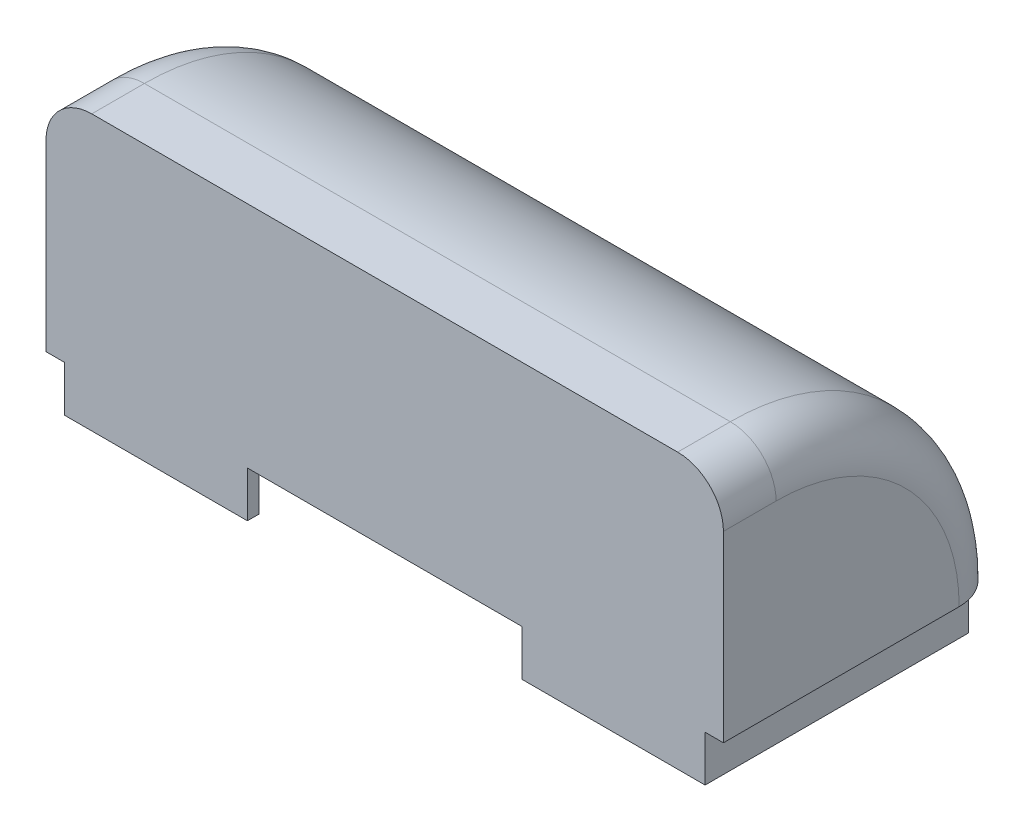
ISO-10303-21;
HEADER;
FILE_DESCRIPTION(('STEP AP214'),'2;1');
FILE_NAME('part.step','',(''),(''),'','','');
FILE_SCHEMA(('AUTOMOTIVE_DESIGN { 1 0 10303 214 1 1 1 1 }'));
ENDSEC;
DATA;
#1=APPLICATION_CONTEXT('core data for automotive mechanical design processes');
#2=APPLICATION_PROTOCOL_DEFINITION('international standard','automotive_design',2000,#1);
#3=PRODUCT_CONTEXT('',#1,'mechanical');
#4=PRODUCT('Part','Part','',(#3));
#5=PRODUCT_RELATED_PRODUCT_CATEGORY('part','',(#4));
#6=PRODUCT_DEFINITION_FORMATION('','',#4);
#7=PRODUCT_DEFINITION_CONTEXT('part definition',#1,'design');
#8=PRODUCT_DEFINITION('design','',#6,#7);
#9=PRODUCT_DEFINITION_SHAPE('','',#8);
#10=(LENGTH_UNIT() NAMED_UNIT(*) SI_UNIT(.MILLI.,.METRE.));
#11=(NAMED_UNIT(*) PLANE_ANGLE_UNIT() SI_UNIT($,.RADIAN.));
#12=(NAMED_UNIT(*) SI_UNIT($,.STERADIAN.) SOLID_ANGLE_UNIT());
#13=UNCERTAINTY_MEASURE_WITH_UNIT(LENGTH_MEASURE(1.E-05),#10,'distance_accuracy_value','');
#14=(GEOMETRIC_REPRESENTATION_CONTEXT(3) GLOBAL_UNCERTAINTY_ASSIGNED_CONTEXT((#13)) GLOBAL_UNIT_ASSIGNED_CONTEXT((#10,
#11,#12)) REPRESENTATION_CONTEXT('',''));
#15=CARTESIAN_POINT('',(0.,0.,0.));
#16=DIRECTION('',(0.,0.,1.));
#17=DIRECTION('',(1.,0.,0.));
#18=AXIS2_PLACEMENT_3D('',#15,#16,#17);
#19=CARTESIAN_POINT('',(0.,12.,0.));
#20=DIRECTION('',(0.,1.,0.));
#21=DIRECTION('',(0.,0.,1.));
#22=AXIS2_PLACEMENT_3D('',#19,#20,#21);
#23=PLANE('',#22);
#24=DIRECTION('',(1.,0.,0.));
#25=VECTOR('',#24,1.);
#26=CARTESIAN_POINT('',(-14.801,12.,3.45));
#27=LINE('',#26,#25);
#28=CARTESIAN_POINT('',(-12.8,12.,3.45));
#29=VERTEX_POINT('',#28);
#30=CARTESIAN_POINT('',(12.8,12.,3.45));
#31=VERTEX_POINT('',#30);
#32=EDGE_CURVE('E189',#29,#31,#27,.T.);
#33=ORIENTED_EDGE('',*,*,#32,.F.);
#34=DIRECTION('',(0.,0.,1.));
#35=VECTOR('',#34,1.);
#36=CARTESIAN_POINT('',(-12.8,12.,5.75));
#37=LINE('',#36,#35);
#38=CARTESIAN_POINT('',(-12.8,12.,5.75));
#39=VERTEX_POINT('',#38);
#40=EDGE_CURVE('E284',#29,#39,#37,.T.);
#41=ORIENTED_EDGE('',*,*,#40,.T.);
#42=DIRECTION('',(1.,0.,0.));
#43=VECTOR('',#42,1.);
#44=CARTESIAN_POINT('',(0.,12.,5.75));
#45=LINE('',#44,#43);
#46=CARTESIAN_POINT('',(12.8,12.,5.75));
#47=VERTEX_POINT('',#46);
#48=EDGE_CURVE('E206',#39,#47,#45,.T.);
#49=ORIENTED_EDGE('',*,*,#48,.T.);
#50=DIRECTION('',(0.,0.,-1.));
#51=VECTOR('',#50,1.);
#52=CARTESIAN_POINT('',(12.8,12.,3.45));
#53=LINE('',#52,#51);
#54=EDGE_CURVE('E281',#47,#31,#53,.T.);
#55=ORIENTED_EDGE('',*,*,#54,.T.);
#56=EDGE_LOOP('',(#33,#41,#49,#55));
#57=FACE_BOUND('',#56,.T.);
#58=ADVANCED_FACE('F35',(#57),#23,.T.);
#59=CARTESIAN_POINT('',(-6.,2.,0.));
#60=DIRECTION('',(-1.,0.,0.));
#61=DIRECTION('',(0.,0.,1.));
#62=AXIS2_PLACEMENT_3D('',#59,#60,#61);
#63=PLANE('',#62);
#64=DIRECTION('',(0.,0.,-1.));
#65=VECTOR('',#64,1.);
#66=CARTESIAN_POINT('',(-6.,0.,0.));
#67=LINE('',#66,#65);
#68=CARTESIAN_POINT('',(-6.,0.,5.75));
#69=VERTEX_POINT('',#68);
#70=CARTESIAN_POINT('',(-6.,0.,5.25));
#71=VERTEX_POINT('',#70);
#72=EDGE_CURVE('E235',#69,#71,#67,.T.);
#73=ORIENTED_EDGE('',*,*,#72,.T.);
#74=DIRECTION('',(0.,-1.,0.));
#75=VECTOR('',#74,1.);
#76=CARTESIAN_POINT('',(-6.,2.,5.25));
#77=LINE('',#76,#75);
#78=CARTESIAN_POINT('',(-6.,2.,5.25));
#79=VERTEX_POINT('',#78);
#80=EDGE_CURVE('E275',#79,#71,#77,.T.);
#81=ORIENTED_EDGE('',*,*,#80,.F.);
#82=DIRECTION('',(0.,0.,-1.));
#83=VECTOR('',#82,1.);
#84=CARTESIAN_POINT('',(-6.,2.,0.));
#85=LINE('',#84,#83);
#86=CARTESIAN_POINT('',(-6.,2.,5.75));
#87=VERTEX_POINT('',#86);
#88=EDGE_CURVE('E209',#87,#79,#85,.T.);
#89=ORIENTED_EDGE('',*,*,#88,.F.);
#90=DIRECTION('',(0.,-1.,0.));
#91=VECTOR('',#90,1.);
#92=CARTESIAN_POINT('',(-6.,2.,5.75));
#93=LINE('',#92,#91);
#94=EDGE_CURVE('E278',#87,#69,#93,.T.);
#95=ORIENTED_EDGE('',*,*,#94,.T.);
#96=EDGE_LOOP('',(#73,#81,#89,#95));
#97=FACE_BOUND('',#96,.T.);
#98=ADVANCED_FACE('F350',(#97),#63,.F.);
#99=CARTESIAN_POINT('',(0.,2.,5.25));
#100=DIRECTION('',(0.,0.,1.));
#101=DIRECTION('',(1.,0.,0.));
#102=AXIS2_PLACEMENT_3D('',#99,#100,#101);
#103=PLANE('',#102);
#104=DIRECTION('',(-1.,0.,0.));
#105=VECTOR('',#104,1.);
#106=CARTESIAN_POINT('',(0.,0.,5.25));
#107=LINE('',#106,#105);
#108=CARTESIAN_POINT('',(-13.5,0.,5.25));
#109=VERTEX_POINT('',#108);
#110=EDGE_CURVE('E238',#71,#109,#107,.T.);
#111=ORIENTED_EDGE('',*,*,#110,.T.);
#112=DIRECTION('',(0.,-1.,0.));
#113=VECTOR('',#112,1.);
#114=CARTESIAN_POINT('',(-13.5,2.,5.25));
#115=LINE('',#114,#113);
#116=CARTESIAN_POINT('',(-13.5,2.,5.25));
#117=VERTEX_POINT('',#116);
#118=EDGE_CURVE('E272',#117,#109,#115,.T.);
#119=ORIENTED_EDGE('',*,*,#118,.F.);
#120=DIRECTION('',(-1.,0.,0.));
#121=VECTOR('',#120,1.);
#122=CARTESIAN_POINT('',(0.,2.,5.25));
#123=LINE('',#122,#121);
#124=EDGE_CURVE('E212',#79,#117,#123,.T.);
#125=ORIENTED_EDGE('',*,*,#124,.F.);
#126=ORIENTED_EDGE('',*,*,#80,.T.);
#127=EDGE_LOOP('',(#111,#119,#125,#126));
#128=FACE_BOUND('',#127,.T.);
#129=ADVANCED_FACE('F382',(#128),#103,.F.);
#130=CARTESIAN_POINT('',(-13.5,2.,0.));
#131=DIRECTION('',(-1.,0.,0.));
#132=DIRECTION('',(0.,0.,1.));
#133=AXIS2_PLACEMENT_3D('',#130,#131,#132);
#134=PLANE('',#133);
#135=DIRECTION('',(0.,0.,-1.));
#136=VECTOR('',#135,1.);
#137=CARTESIAN_POINT('',(-13.5,0.,0.));
#138=LINE('',#137,#136);
#139=CARTESIAN_POINT('',(-13.5,0.,-5.25));
#140=VERTEX_POINT('',#139);
#141=EDGE_CURVE('E240',#109,#140,#138,.T.);
#142=ORIENTED_EDGE('',*,*,#141,.T.);
#143=DIRECTION('',(0.,0.707106781186552,0.707106781186543));
#144=VECTOR('',#143,1.);
#145=CARTESIAN_POINT('',(-13.5,0.,-5.25));
#146=LINE('',#145,#144);
#147=CARTESIAN_POINT('',(-13.5,2.,-3.25000000000001));
#148=VERTEX_POINT('',#147);
#149=EDGE_CURVE('E57',#140,#148,#146,.T.);
#150=ORIENTED_EDGE('',*,*,#149,.T.);
#151=DIRECTION('',(0.,0.,-1.));
#152=VECTOR('',#151,1.);
#153=CARTESIAN_POINT('',(-13.5,2.,0.));
#154=LINE('',#153,#152);
#155=EDGE_CURVE('E216',#117,#148,#154,.T.);
#156=ORIENTED_EDGE('',*,*,#155,.F.);
#157=ORIENTED_EDGE('',*,*,#118,.T.);
#158=EDGE_LOOP('',(#142,#150,#156,#157));
#159=FACE_BOUND('',#158,.T.);
#160=ADVANCED_FACE('F414',(#159),#134,.F.);
#161=CARTESIAN_POINT('',(13.5,2.,0.));
#162=DIRECTION('',(-1.,0.,0.));
#163=DIRECTION('',(0.,0.,1.));
#164=AXIS2_PLACEMENT_3D('',#161,#162,#163);
#165=PLANE('',#164);
#166=DIRECTION('',(0.,0.,-1.));
#167=VECTOR('',#166,1.);
#168=CARTESIAN_POINT('',(13.5,2.,0.));
#169=LINE('',#168,#167);
#170=CARTESIAN_POINT('',(13.5,2.,5.25));
#171=VERTEX_POINT('',#170);
#172=CARTESIAN_POINT('',(13.5,2.,-3.25000000000001));
#173=VERTEX_POINT('',#172);
#174=EDGE_CURVE('E219',#171,#173,#169,.T.);
#175=ORIENTED_EDGE('',*,*,#174,.T.);
#176=DIRECTION('',(0.,-0.707106781186552,-0.707106781186543));
#177=VECTOR('',#176,1.);
#178=CARTESIAN_POINT('',(13.5,3.625,-1.62500000000002));
#179=LINE('',#178,#177);
#180=CARTESIAN_POINT('',(13.5,0.,-5.25));
#181=VERTEX_POINT('',#180);
#182=EDGE_CURVE('E11',#173,#181,#179,.T.);
#183=ORIENTED_EDGE('',*,*,#182,.T.);
#184=DIRECTION('',(0.,0.,-1.));
#185=VECTOR('',#184,1.);
#186=CARTESIAN_POINT('',(13.5,0.,0.));
#187=LINE('',#186,#185);
#188=CARTESIAN_POINT('',(13.5,0.,5.25));
#189=VERTEX_POINT('',#188);
#190=EDGE_CURVE('E246',#189,#181,#187,.T.);
#191=ORIENTED_EDGE('',*,*,#190,.F.);
#192=DIRECTION('',(0.,-1.,0.));
#193=VECTOR('',#192,1.);
#194=CARTESIAN_POINT('',(13.5,2.,5.25));
#195=LINE('',#194,#193);
#196=EDGE_CURVE('E270',#171,#189,#195,.T.);
#197=ORIENTED_EDGE('',*,*,#196,.F.);
#198=EDGE_LOOP('',(#175,#183,#191,#197));
#199=FACE_BOUND('',#198,.T.);
#200=ADVANCED_FACE('F408',(#199),#165,.T.);
#201=CARTESIAN_POINT('',(6.,0.,5.25));
#202=VERTEX_POINT('',#201);
#203=EDGE_CURVE('E241',#189,#202,#107,.T.);
#204=ORIENTED_EDGE('',*,*,#203,.T.);
#205=DIRECTION('',(0.,-1.,0.));
#206=VECTOR('',#205,1.);
#207=CARTESIAN_POINT('',(6.,2.,5.25));
#208=LINE('',#207,#206);
#209=CARTESIAN_POINT('',(6.,2.,5.25));
#210=VERTEX_POINT('',#209);
#211=EDGE_CURVE('E268',#210,#202,#208,.T.);
#212=ORIENTED_EDGE('',*,*,#211,.F.);
#213=EDGE_CURVE('E217',#171,#210,#123,.T.);
#214=ORIENTED_EDGE('',*,*,#213,.F.);
#215=ORIENTED_EDGE('',*,*,#196,.T.);
#216=EDGE_LOOP('',(#204,#212,#214,#215));
#217=FACE_BOUND('',#216,.T.);
#218=ADVANCED_FACE('F413',(#217),#103,.F.);
#219=CARTESIAN_POINT('',(6.,2.,0.));
#220=DIRECTION('',(-1.,0.,0.));
#221=DIRECTION('',(0.,0.,1.));
#222=AXIS2_PLACEMENT_3D('',#219,#220,#221);
#223=PLANE('',#222);
#224=DIRECTION('',(0.,0.,-1.));
#225=VECTOR('',#224,1.);
#226=CARTESIAN_POINT('',(6.,0.,0.));
#227=LINE('',#226,#225);
#228=CARTESIAN_POINT('',(6.,0.,5.75));
#229=VERTEX_POINT('',#228);
#230=EDGE_CURVE('E249',#229,#202,#227,.T.);
#231=ORIENTED_EDGE('',*,*,#230,.F.);
#232=DIRECTION('',(0.,-1.,0.));
#233=VECTOR('',#232,1.);
#234=CARTESIAN_POINT('',(6.,2.,5.75));
#235=LINE('',#234,#233);
#236=CARTESIAN_POINT('',(6.,2.,5.75));
#237=VERTEX_POINT('',#236);
#238=EDGE_CURVE('E266',#237,#229,#235,.T.);
#239=ORIENTED_EDGE('',*,*,#238,.F.);
#240=DIRECTION('',(0.,0.,-1.));
#241=VECTOR('',#240,1.);
#242=CARTESIAN_POINT('',(6.,2.,0.));
#243=LINE('',#242,#241);
#244=EDGE_CURVE('E221',#237,#210,#243,.T.);
#245=ORIENTED_EDGE('',*,*,#244,.T.);
#246=ORIENTED_EDGE('',*,*,#211,.T.);
#247=EDGE_LOOP('',(#231,#239,#245,#246));
#248=FACE_BOUND('',#247,.T.);
#249=ADVANCED_FACE('F359',(#248),#223,.T.);
#250=CARTESIAN_POINT('',(0.,2.,5.75));
#251=DIRECTION('',(0.,0.,-1.));
#252=DIRECTION('',(-1.,0.,0.));
#253=AXIS2_PLACEMENT_3D('',#250,#251,#252);
#254=PLANE('',#253);
#255=ORIENTED_EDGE('',*,*,#48,.F.);
#256=CARTESIAN_POINT('',(-12.8,10.,5.75));
#257=DIRECTION('',(0.,0.,-1.));
#258=DIRECTION('',(-1.,0.,0.));
#259=AXIS2_PLACEMENT_3D('',#256,#257,#258);
#260=CIRCLE('',#259,2.);
#261=CARTESIAN_POINT('',(-14.8,10.,5.75));
#262=VERTEX_POINT('',#261);
#263=EDGE_CURVE('E289',#39,#262,#260,.F.);
#264=ORIENTED_EDGE('',*,*,#263,.T.);
#265=DIRECTION('',(0.,-1.,0.));
#266=VECTOR('',#265,1.);
#267=CARTESIAN_POINT('',(-14.8,12.,5.75));
#268=LINE('',#267,#266);
#269=CARTESIAN_POINT('',(-14.8,2.,5.75));
#270=VERTEX_POINT('',#269);
#271=EDGE_CURVE('E177',#262,#270,#268,.T.);
#272=ORIENTED_EDGE('',*,*,#271,.T.);
#273=DIRECTION('',(1.,0.,0.));
#274=VECTOR('',#273,1.);
#275=CARTESIAN_POINT('',(0.,2.,5.75));
#276=LINE('',#275,#274);
#277=CARTESIAN_POINT('',(-14.,2.,5.75));
#278=VERTEX_POINT('',#277);
#279=EDGE_CURVE('E191',#270,#278,#276,.T.);
#280=ORIENTED_EDGE('',*,*,#279,.T.);
#281=DIRECTION('',(0.,-1.,0.));
#282=VECTOR('',#281,1.);
#283=CARTESIAN_POINT('',(-14.,2.,5.75));
#284=LINE('',#283,#282);
#285=CARTESIAN_POINT('',(-14.,0.,5.75));
#286=VERTEX_POINT('',#285);
#287=EDGE_CURVE('E232',#278,#286,#284,.T.);
#288=ORIENTED_EDGE('',*,*,#287,.T.);
#289=DIRECTION('',(1.,0.,0.));
#290=VECTOR('',#289,1.);
#291=CARTESIAN_POINT('',(0.,0.,5.75));
#292=LINE('',#291,#290);
#293=EDGE_CURVE('E176',#286,#69,#292,.T.);
#294=ORIENTED_EDGE('',*,*,#293,.T.);
#295=ORIENTED_EDGE('',*,*,#94,.F.);
#296=EDGE_CURVE('E188',#87,#237,#276,.T.);
#297=ORIENTED_EDGE('',*,*,#296,.T.);
#298=ORIENTED_EDGE('',*,*,#238,.T.);
#299=CARTESIAN_POINT('',(14.,0.,5.75));
#300=VERTEX_POINT('',#299);
#301=EDGE_CURVE('E236',#229,#300,#292,.T.);
#302=ORIENTED_EDGE('',*,*,#301,.T.);
#303=DIRECTION('',(0.,-1.,0.));
#304=VECTOR('',#303,1.);
#305=CARTESIAN_POINT('',(14.,2.,5.75));
#306=LINE('',#305,#304);
#307=CARTESIAN_POINT('',(14.,2.,5.75));
#308=VERTEX_POINT('',#307);
#309=EDGE_CURVE('E184',#308,#300,#306,.T.);
#310=ORIENTED_EDGE('',*,*,#309,.F.);
#311=CARTESIAN_POINT('',(14.8,2.,5.75));
#312=VERTEX_POINT('',#311);
#313=EDGE_CURVE('E180',#308,#312,#276,.T.);
#314=ORIENTED_EDGE('',*,*,#313,.T.);
#315=DIRECTION('',(0.,-1.,0.));
#316=VECTOR('',#315,1.);
#317=CARTESIAN_POINT('',(14.8,12.,5.75));
#318=LINE('',#317,#316);
#319=CARTESIAN_POINT('',(14.8,10.,5.75));
#320=VERTEX_POINT('',#319);
#321=EDGE_CURVE('E166',#320,#312,#318,.T.);
#322=ORIENTED_EDGE('',*,*,#321,.F.);
#323=CARTESIAN_POINT('',(12.8,10.,5.75));
#324=DIRECTION('',(0.,0.,-1.));
#325=DIRECTION('',(-1.,0.,0.));
#326=AXIS2_PLACEMENT_3D('',#323,#324,#325);
#327=CIRCLE('',#326,2.);
#328=EDGE_CURVE('E287',#320,#47,#327,.F.);
#329=ORIENTED_EDGE('',*,*,#328,.T.);
#330=EDGE_LOOP('',(#255,#264,#272,#280,#288,#294,#295,#297,#298,#302,#310,#314,#322,#329));
#331=FACE_BOUND('',#330,.T.);
#332=ADVANCED_FACE('F182',(#331),#254,.F.);
#333=CARTESIAN_POINT('',(14.,2.,0.));
#334=DIRECTION('',(1.,0.,0.));
#335=DIRECTION('',(0.,0.,-1.));
#336=AXIS2_PLACEMENT_3D('',#333,#334,#335);
#337=PLANE('',#336);
#338=DIRECTION('',(0.,0.,1.));
#339=VECTOR('',#338,1.);
#340=CARTESIAN_POINT('',(14.,0.,0.));
#341=LINE('',#340,#339);
#342=CARTESIAN_POINT('',(14.,0.,-5.75));
#343=VERTEX_POINT('',#342);
#344=EDGE_CURVE('E252',#343,#300,#341,.T.);
#345=ORIENTED_EDGE('',*,*,#344,.F.);
#346=DIRECTION('',(0.,-1.,0.));
#347=VECTOR('',#346,1.);
#348=CARTESIAN_POINT('',(14.,2.,-5.75));
#349=LINE('',#348,#347);
#350=CARTESIAN_POINT('',(14.,2.,-5.75));
#351=VERTEX_POINT('',#350);
#352=EDGE_CURVE('E263',#351,#343,#349,.T.);
#353=ORIENTED_EDGE('',*,*,#352,.F.);
#354=DIRECTION('',(0.,0.,1.));
#355=VECTOR('',#354,1.);
#356=CARTESIAN_POINT('',(14.,2.,0.));
#357=LINE('',#356,#355);
#358=EDGE_CURVE('E224',#351,#308,#357,.T.);
#359=ORIENTED_EDGE('',*,*,#358,.T.);
#360=ORIENTED_EDGE('',*,*,#309,.T.);
#361=EDGE_LOOP('',(#345,#353,#359,#360));
#362=FACE_BOUND('',#361,.T.);
#363=ADVANCED_FACE('F365',(#362),#337,.T.);
#364=CARTESIAN_POINT('',(0.,2.,-5.75));
#365=DIRECTION('',(0.,0.,-1.));
#366=DIRECTION('',(-1.,0.,0.));
#367=AXIS2_PLACEMENT_3D('',#364,#365,#366);
#368=PLANE('',#367);
#369=DIRECTION('',(1.,0.,0.));
#370=VECTOR('',#369,1.);
#371=CARTESIAN_POINT('',(0.,0.,-5.75));
#372=LINE('',#371,#370);
#373=CARTESIAN_POINT('',(-14.,0.,-5.75));
#374=VERTEX_POINT('',#373);
#375=EDGE_CURVE('E255',#374,#343,#372,.T.);
#376=ORIENTED_EDGE('',*,*,#375,.F.);
#377=DIRECTION('',(0.,-1.,0.));
#378=VECTOR('',#377,1.);
#379=CARTESIAN_POINT('',(-14.,2.,-5.75));
#380=LINE('',#379,#378);
#381=CARTESIAN_POINT('',(-14.,2.,-5.75));
#382=VERTEX_POINT('',#381);
#383=EDGE_CURVE('E261',#382,#374,#380,.T.);
#384=ORIENTED_EDGE('',*,*,#383,.F.);
#385=DIRECTION('',(1.,0.,0.));
#386=VECTOR('',#385,1.);
#387=CARTESIAN_POINT('',(0.,2.,-5.75));
#388=LINE('',#387,#386);
#389=EDGE_CURVE('E226',#382,#351,#388,.T.);
#390=ORIENTED_EDGE('',*,*,#389,.T.);
#391=ORIENTED_EDGE('',*,*,#352,.T.);
#392=EDGE_LOOP('',(#376,#384,#390,#391));
#393=FACE_BOUND('',#392,.T.);
#394=ADVANCED_FACE('F367',(#393),#368,.T.);
#395=CARTESIAN_POINT('',(-14.,2.,0.));
#396=DIRECTION('',(1.,0.,0.));
#397=DIRECTION('',(0.,0.,-1.));
#398=AXIS2_PLACEMENT_3D('',#395,#396,#397);
#399=PLANE('',#398);
#400=DIRECTION('',(0.,0.,1.));
#401=VECTOR('',#400,1.);
#402=CARTESIAN_POINT('',(-14.,0.,0.));
#403=LINE('',#402,#401);
#404=EDGE_CURVE('E213',#374,#286,#403,.T.);
#405=ORIENTED_EDGE('',*,*,#404,.T.);
#406=ORIENTED_EDGE('',*,*,#287,.F.);
#407=DIRECTION('',(0.,0.,1.));
#408=VECTOR('',#407,1.);
#409=CARTESIAN_POINT('',(-14.,2.,0.));
#410=LINE('',#409,#408);
#411=EDGE_CURVE('E229',#382,#278,#410,.T.);
#412=ORIENTED_EDGE('',*,*,#411,.F.);
#413=ORIENTED_EDGE('',*,*,#383,.T.);
#414=EDGE_LOOP('',(#405,#406,#412,#413));
#415=FACE_BOUND('',#414,.T.);
#416=ADVANCED_FACE('F368',(#415),#399,.F.);
#417=CARTESIAN_POINT('',(0.,0.,0.));
#418=DIRECTION('',(0.,1.,0.));
#419=DIRECTION('',(0.,0.,1.));
#420=AXIS2_PLACEMENT_3D('',#417,#418,#419);
#421=PLANE('',#420);
#422=ORIENTED_EDGE('',*,*,#293,.F.);
#423=ORIENTED_EDGE('',*,*,#404,.F.);
#424=ORIENTED_EDGE('',*,*,#375,.T.);
#425=ORIENTED_EDGE('',*,*,#344,.T.);
#426=ORIENTED_EDGE('',*,*,#301,.F.);
#427=ORIENTED_EDGE('',*,*,#230,.T.);
#428=ORIENTED_EDGE('',*,*,#203,.F.);
#429=ORIENTED_EDGE('',*,*,#190,.T.);
#430=DIRECTION('',(-1.,0.,0.));
#431=VECTOR('',#430,1.);
#432=CARTESIAN_POINT('',(0.,0.,-5.25));
#433=LINE('',#432,#431);
#434=EDGE_CURVE('E243',#181,#140,#433,.T.);
#435=ORIENTED_EDGE('',*,*,#434,.T.);
#436=ORIENTED_EDGE('',*,*,#141,.F.);
#437=ORIENTED_EDGE('',*,*,#110,.F.);
#438=ORIENTED_EDGE('',*,*,#72,.F.);
#439=EDGE_LOOP('',(#422,#423,#424,#425,#426,#427,#428,#429,#435,#436,#437,#438));
#440=FACE_BOUND('',#439,.T.);
#441=ADVANCED_FACE('F345',(#440),#421,.F.);
#442=CARTESIAN_POINT('',(0.,2.,0.));
#443=DIRECTION('',(0.,1.,0.));
#444=DIRECTION('',(0.,0.,1.));
#445=AXIS2_PLACEMENT_3D('',#442,#443,#444);
#446=PLANE('',#445);
#447=ORIENTED_EDGE('',*,*,#155,.T.);
#448=DIRECTION('',(1.,0.,0.));
#449=VECTOR('',#448,1.);
#450=CARTESIAN_POINT('',(0.,2.,-3.25000000000001));
#451=LINE('',#450,#449);
#452=EDGE_CURVE('E43',#148,#173,#451,.T.);
#453=ORIENTED_EDGE('',*,*,#452,.T.);
#454=ORIENTED_EDGE('',*,*,#174,.F.);
#455=ORIENTED_EDGE('',*,*,#213,.T.);
#456=ORIENTED_EDGE('',*,*,#244,.F.);
#457=ORIENTED_EDGE('',*,*,#296,.F.);
#458=ORIENTED_EDGE('',*,*,#88,.T.);
#459=ORIENTED_EDGE('',*,*,#124,.T.);
#460=EDGE_LOOP('',(#447,#453,#454,#455,#456,#457,#458,#459));
#461=FACE_BOUND('',#460,.T.);
#462=ADVANCED_FACE('F354',(#461),#446,.F.);
#463=CARTESIAN_POINT('',(14.8,12.,0.));
#464=DIRECTION('',(-1.,0.,0.));
#465=DIRECTION('',(0.,0.,1.));
#466=AXIS2_PLACEMENT_3D('',#463,#464,#465);
#467=PLANE('',#466);
#468=CARTESIAN_POINT('',(14.8,2.,3.45));
#469=DIRECTION('',(-1.,0.,0.));
#470=DIRECTION('',(0.,0.,1.));
#471=AXIS2_PLACEMENT_3D('',#468,#469,#470);
#472=CIRCLE('',#471,8.);
#473=CARTESIAN_POINT('',(14.8,2.,-4.55));
#474=VERTEX_POINT('',#473);
#475=CARTESIAN_POINT('',(14.8,10.,3.45));
#476=VERTEX_POINT('',#475);
#477=EDGE_CURVE('E295',#474,#476,#472,.F.);
#478=ORIENTED_EDGE('',*,*,#477,.T.);
#479=DIRECTION('',(0.,0.,-1.));
#480=VECTOR('',#479,1.);
#481=CARTESIAN_POINT('',(14.8,10.,5.75));
#482=LINE('',#481,#480);
#483=EDGE_CURVE('E173',#476,#320,#482,.F.);
#484=ORIENTED_EDGE('',*,*,#483,.T.);
#485=ORIENTED_EDGE('',*,*,#321,.T.);
#486=DIRECTION('',(0.,0.,-1.));
#487=VECTOR('',#486,1.);
#488=CARTESIAN_POINT('',(14.8,2.,0.));
#489=LINE('',#488,#487);
#490=EDGE_CURVE('E170',#312,#474,#489,.T.);
#491=ORIENTED_EDGE('',*,*,#490,.T.);
#492=EDGE_LOOP('',(#478,#484,#485,#491));
#493=FACE_BOUND('',#492,.T.);
#494=ADVANCED_FACE('F168',(#493),#467,.F.);
#495=CARTESIAN_POINT('',(-14.8,12.,0.));
#496=DIRECTION('',(1.,0.,0.));
#497=DIRECTION('',(0.,0.,-1.));
#498=AXIS2_PLACEMENT_3D('',#495,#496,#497);
#499=PLANE('',#498);
#500=ORIENTED_EDGE('',*,*,#271,.F.);
#501=DIRECTION('',(0.,0.,1.));
#502=VECTOR('',#501,1.);
#503=CARTESIAN_POINT('',(-14.8,10.,3.45));
#504=LINE('',#503,#502);
#505=CARTESIAN_POINT('',(-14.8,10.,3.45));
#506=VERTEX_POINT('',#505);
#507=EDGE_CURVE('E293',#262,#506,#504,.F.);
#508=ORIENTED_EDGE('',*,*,#507,.T.);
#509=CARTESIAN_POINT('',(-14.8,2.,3.45));
#510=DIRECTION('',(1.,0.,0.));
#511=DIRECTION('',(0.,0.,-1.));
#512=AXIS2_PLACEMENT_3D('',#509,#510,#511);
#513=CIRCLE('',#512,8.);
#514=CARTESIAN_POINT('',(-14.8,2.,-4.55));
#515=VERTEX_POINT('',#514);
#516=EDGE_CURVE('E291',#506,#515,#513,.F.);
#517=ORIENTED_EDGE('',*,*,#516,.T.);
#518=DIRECTION('',(0.,0.,1.));
#519=VECTOR('',#518,1.);
#520=CARTESIAN_POINT('',(-14.8,2.,0.));
#521=LINE('',#520,#519);
#522=EDGE_CURVE('E200',#515,#270,#521,.T.);
#523=ORIENTED_EDGE('',*,*,#522,.T.);
#524=EDGE_LOOP('',(#500,#508,#517,#523));
#525=FACE_BOUND('',#524,.T.);
#526=ADVANCED_FACE('F337',(#525),#499,.F.);
#527=ORIENTED_EDGE('',*,*,#522,.F.);
#528=CARTESIAN_POINT('',(-12.8,2.,-4.55));
#529=DIRECTION('',(0.,1.,0.));
#530=DIRECTION('',(0.,0.,1.));
#531=AXIS2_PLACEMENT_3D('',#528,#529,#530);
#532=CIRCLE('',#531,2.);
#533=CARTESIAN_POINT('',(-12.8,2.,-6.55));
#534=VERTEX_POINT('',#533);
#535=EDGE_CURVE('E303',#515,#534,#532,.F.);
#536=ORIENTED_EDGE('',*,*,#535,.T.);
#537=DIRECTION('',(-1.,0.,0.));
#538=VECTOR('',#537,1.);
#539=CARTESIAN_POINT('',(0.,2.,-6.55));
#540=LINE('',#539,#538);
#541=CARTESIAN_POINT('',(12.8,2.,-6.55));
#542=VERTEX_POINT('',#541);
#543=EDGE_CURVE('E197',#542,#534,#540,.T.);
#544=ORIENTED_EDGE('',*,*,#543,.F.);
#545=CARTESIAN_POINT('',(12.8,2.,-4.55));
#546=DIRECTION('',(0.,1.,0.));
#547=DIRECTION('',(0.,0.,1.));
#548=AXIS2_PLACEMENT_3D('',#545,#546,#547);
#549=CIRCLE('',#548,2.);
#550=EDGE_CURVE('E196',#542,#474,#549,.F.);
#551=ORIENTED_EDGE('',*,*,#550,.T.);
#552=ORIENTED_EDGE('',*,*,#490,.F.);
#553=ORIENTED_EDGE('',*,*,#313,.F.);
#554=ORIENTED_EDGE('',*,*,#358,.F.);
#555=ORIENTED_EDGE('',*,*,#389,.F.);
#556=ORIENTED_EDGE('',*,*,#411,.T.);
#557=ORIENTED_EDGE('',*,*,#279,.F.);
#558=EDGE_LOOP('',(#527,#536,#544,#551,#552,#553,#554,#555,#556,#557));
#559=FACE_BOUND('',#558,.T.);
#560=ADVANCED_FACE('F193',(#559),#446,.F.);
#561=CARTESIAN_POINT('',(-14.801,2.,3.45));
#562=DIRECTION('',(1.,0.,0.));
#563=DIRECTION('',(0.,0.,-1.));
#564=AXIS2_PLACEMENT_3D('',#561,#562,#563);
#565=CYLINDRICAL_SURFACE('',#564,10.);
#566=ORIENTED_EDGE('',*,*,#543,.T.);
#567=CARTESIAN_POINT('',(-12.8,2.,3.45));
#568=DIRECTION('',(1.,0.,0.));
#569=DIRECTION('',(0.,0.,-1.));
#570=AXIS2_PLACEMENT_3D('',#567,#568,#569);
#571=CIRCLE('',#570,10.);
#572=EDGE_CURVE('E300',#534,#29,#571,.T.);
#573=ORIENTED_EDGE('',*,*,#572,.T.);
#574=ORIENTED_EDGE('',*,*,#32,.T.);
#575=CARTESIAN_POINT('',(12.8,2.,3.45));
#576=DIRECTION('',(-1.,0.,0.));
#577=DIRECTION('',(0.,0.,1.));
#578=AXIS2_PLACEMENT_3D('',#575,#576,#577);
#579=CIRCLE('',#578,10.);
#580=EDGE_CURVE('E298',#31,#542,#579,.T.);
#581=ORIENTED_EDGE('',*,*,#580,.T.);
#582=EDGE_LOOP('',(#566,#573,#574,#581));
#583=FACE_BOUND('',#582,.T.);
#584=ADVANCED_FACE('F323',(#583),#565,.T.);
#585=CARTESIAN_POINT('',(-12.8,2.,3.45));
#586=DIRECTION('',(1.,0.,0.));
#587=DIRECTION('',(0.,0.,-1.));
#588=AXIS2_PLACEMENT_3D('',#585,#586,#587);
#589=TOROIDAL_SURFACE('',#588,8.,2.);
#590=ORIENTED_EDGE('',*,*,#535,.F.);
#591=ORIENTED_EDGE('',*,*,#516,.F.);
#592=CARTESIAN_POINT('',(-12.8,10.,3.45));
#593=DIRECTION('',(0.,0.,1.));
#594=DIRECTION('',(1.,0.,0.));
#595=AXIS2_PLACEMENT_3D('',#592,#593,#594);
#596=CIRCLE('',#595,2.);
#597=EDGE_CURVE('E305',#29,#506,#596,.T.);
#598=ORIENTED_EDGE('',*,*,#597,.F.);
#599=ORIENTED_EDGE('',*,*,#572,.F.);
#600=EDGE_LOOP('',(#590,#591,#598,#599));
#601=FACE_BOUND('',#600,.T.);
#602=ADVANCED_FACE('F328',(#601),#589,.T.);
#603=CARTESIAN_POINT('',(-12.8,10.,0.));
#604=DIRECTION('',(0.,0.,-1.));
#605=DIRECTION('',(-1.,0.,0.));
#606=AXIS2_PLACEMENT_3D('',#603,#604,#605);
#607=CYLINDRICAL_SURFACE('',#606,2.);
#608=ORIENTED_EDGE('',*,*,#597,.T.);
#609=ORIENTED_EDGE('',*,*,#507,.F.);
#610=ORIENTED_EDGE('',*,*,#263,.F.);
#611=ORIENTED_EDGE('',*,*,#40,.F.);
#612=EDGE_LOOP('',(#608,#609,#610,#611));
#613=FACE_BOUND('',#612,.T.);
#614=ADVANCED_FACE('F333',(#613),#607,.T.);
#615=CARTESIAN_POINT('',(12.8,2.,3.45));
#616=DIRECTION('',(-1.,0.,0.));
#617=DIRECTION('',(0.,0.,1.));
#618=AXIS2_PLACEMENT_3D('',#615,#616,#617);
#619=TOROIDAL_SURFACE('',#618,8.,2.);
#620=ORIENTED_EDGE('',*,*,#550,.F.);
#621=ORIENTED_EDGE('',*,*,#580,.F.);
#622=CARTESIAN_POINT('',(12.8,10.,3.45));
#623=DIRECTION('',(0.,0.,1.));
#624=DIRECTION('',(1.,0.,0.));
#625=AXIS2_PLACEMENT_3D('',#622,#623,#624);
#626=CIRCLE('',#625,2.);
#627=EDGE_CURVE('E308',#476,#31,#626,.T.);
#628=ORIENTED_EDGE('',*,*,#627,.F.);
#629=ORIENTED_EDGE('',*,*,#477,.F.);
#630=EDGE_LOOP('',(#620,#621,#628,#629));
#631=FACE_BOUND('',#630,.T.);
#632=ADVANCED_FACE('F316',(#631),#619,.T.);
#633=CARTESIAN_POINT('',(12.8,10.,0.));
#634=DIRECTION('',(0.,0.,1.));
#635=DIRECTION('',(1.,0.,0.));
#636=AXIS2_PLACEMENT_3D('',#633,#634,#635);
#637=CYLINDRICAL_SURFACE('',#636,2.);
#638=ORIENTED_EDGE('',*,*,#328,.F.);
#639=ORIENTED_EDGE('',*,*,#483,.F.);
#640=ORIENTED_EDGE('',*,*,#627,.T.);
#641=ORIENTED_EDGE('',*,*,#54,.F.);
#642=EDGE_LOOP('',(#638,#639,#640,#641));
#643=FACE_BOUND('',#642,.T.);
#644=ADVANCED_FACE('F314',(#643),#637,.T.);
#645=CARTESIAN_POINT('',(0.,0.,-5.25));
#646=DIRECTION('',(0.,0.707106781186543,-0.707106781186552));
#647=DIRECTION('',(-1.,0.,0.));
#648=AXIS2_PLACEMENT_3D('',#645,#646,#647);
#649=PLANE('',#648);
#650=ORIENTED_EDGE('',*,*,#182,.F.);
#651=ORIENTED_EDGE('',*,*,#452,.F.);
#652=ORIENTED_EDGE('',*,*,#149,.F.);
#653=ORIENTED_EDGE('',*,*,#434,.F.);
#654=EDGE_LOOP('',(#650,#651,#652,#653));
#655=FACE_BOUND('',#654,.T.);
#656=ADVANCED_FACE('F37',(#655),#649,.F.);
#657=CLOSED_SHELL('',(#58,#98,#129,#160,#200,#218,#249,#332,#363,#394,#416,#441,#462,#494,#526,
#560,#584,#602,#614,#632,#644,#656));
#658=MANIFOLD_SOLID_BREP('B2',#657);
#659=ADVANCED_BREP_SHAPE_REPRESENTATION('',(#18,#658),#14);
#660=SHAPE_DEFINITION_REPRESENTATION(#9,#659);
ENDSEC;
END-ISO-10303-21;
